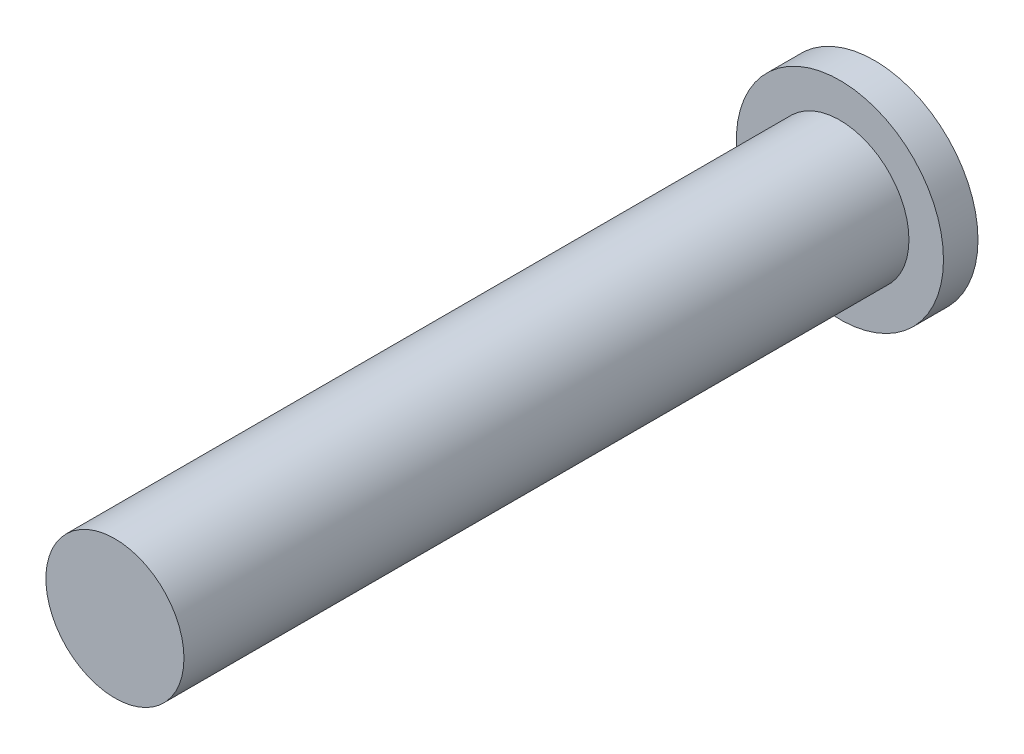
ISO-10303-21;
HEADER;
FILE_DESCRIPTION(('STEP AP214'),'2;1');
FILE_NAME('part.step','',(''),(''),'','','');
FILE_SCHEMA(('AUTOMOTIVE_DESIGN { 1 0 10303 214 1 1 1 1 }'));
ENDSEC;
DATA;
#1=APPLICATION_CONTEXT('core data for automotive mechanical design processes');
#2=APPLICATION_PROTOCOL_DEFINITION('international standard','automotive_design',2000,#1);
#3=PRODUCT_CONTEXT('',#1,'mechanical');
#4=PRODUCT('Part','Part','',(#3));
#5=PRODUCT_RELATED_PRODUCT_CATEGORY('part','',(#4));
#6=PRODUCT_DEFINITION_FORMATION('','',#4);
#7=PRODUCT_DEFINITION_CONTEXT('part definition',#1,'design');
#8=PRODUCT_DEFINITION('design','',#6,#7);
#9=PRODUCT_DEFINITION_SHAPE('','',#8);
#10=(LENGTH_UNIT() NAMED_UNIT(*) SI_UNIT(.MILLI.,.METRE.));
#11=(NAMED_UNIT(*) PLANE_ANGLE_UNIT() SI_UNIT($,.RADIAN.));
#12=(NAMED_UNIT(*) SI_UNIT($,.STERADIAN.) SOLID_ANGLE_UNIT());
#13=UNCERTAINTY_MEASURE_WITH_UNIT(LENGTH_MEASURE(1.E-05),#10,'distance_accuracy_value','');
#14=(GEOMETRIC_REPRESENTATION_CONTEXT(3) GLOBAL_UNCERTAINTY_ASSIGNED_CONTEXT((#13)) GLOBAL_UNIT_ASSIGNED_CONTEXT((#10,
#11,#12)) REPRESENTATION_CONTEXT('',''));
#15=CARTESIAN_POINT('',(0.,0.,0.));
#16=DIRECTION('',(0.,0.,1.));
#17=DIRECTION('',(1.,0.,0.));
#18=AXIS2_PLACEMENT_3D('',#15,#16,#17);
#19=CARTESIAN_POINT('',(0.,0.,21.));
#20=DIRECTION('',(0.,0.,-1.));
#21=DIRECTION('',(-1.,0.,0.));
#22=AXIS2_PLACEMENT_3D('',#19,#20,#21);
#23=CYLINDRICAL_SURFACE('',#22,2.);
#24=CARTESIAN_POINT('',(0.,0.,21.));
#25=DIRECTION('',(0.,0.,1.));
#26=DIRECTION('',(1.,0.,0.));
#27=AXIS2_PLACEMENT_3D('',#24,#25,#26);
#28=CIRCLE('',#27,2.);
#29=CARTESIAN_POINT('',(2.,0.,21.));
#30=VERTEX_POINT('',#29);
#31=EDGE_CURVE('E10',#30,#30,#28,.T.);
#32=ORIENTED_EDGE('',*,*,#31,.F.);
#33=EDGE_LOOP('',(#32));
#34=FACE_BOUND('',#33,.T.);
#35=CARTESIAN_POINT('',(0.,0.,0.));
#36=DIRECTION('',(0.,0.,1.));
#37=DIRECTION('',(1.,0.,0.));
#38=AXIS2_PLACEMENT_3D('',#35,#36,#37);
#39=CIRCLE('',#38,2.);
#40=CARTESIAN_POINT('',(2.,0.,0.));
#41=VERTEX_POINT('',#40);
#42=EDGE_CURVE('E39',#41,#41,#39,.T.);
#43=ORIENTED_EDGE('',*,*,#42,.T.);
#44=EDGE_LOOP('',(#43));
#45=FACE_BOUND('',#44,.T.);
#46=ADVANCED_FACE('F33',(#34,#45),#23,.T.);
#47=CARTESIAN_POINT('',(0.,0.,21.));
#48=DIRECTION('',(0.,0.,1.));
#49=DIRECTION('',(1.,0.,0.));
#50=AXIS2_PLACEMENT_3D('',#47,#48,#49);
#51=PLANE('',#50);
#52=ORIENTED_EDGE('',*,*,#31,.T.);
#53=EDGE_LOOP('',(#52));
#54=FACE_BOUND('',#53,.T.);
#55=ADVANCED_FACE('F67',(#54),#51,.T.);
#56=CARTESIAN_POINT('',(0.,0.,0.));
#57=DIRECTION('',(0.,0.,1.));
#58=DIRECTION('',(1.,0.,0.));
#59=AXIS2_PLACEMENT_3D('',#56,#57,#58);
#60=PLANE('',#59);
#61=CARTESIAN_POINT('',(0.,0.,0.));
#62=DIRECTION('',(0.,0.,1.));
#63=DIRECTION('',(1.,0.,0.));
#64=AXIS2_PLACEMENT_3D('',#61,#62,#63);
#65=CIRCLE('',#64,3.);
#66=CARTESIAN_POINT('',(3.,0.,0.));
#67=VERTEX_POINT('',#66);
#68=EDGE_CURVE('E47',#67,#67,#65,.T.);
#69=ORIENTED_EDGE('',*,*,#68,.T.);
#70=EDGE_LOOP('',(#69));
#71=FACE_BOUND('',#70,.T.);
#72=ORIENTED_EDGE('',*,*,#42,.F.);
#73=EDGE_LOOP('',(#72));
#74=FACE_BOUND('',#73,.T.);
#75=ADVANCED_FACE('F53',(#71,#74),#60,.T.);
#76=CARTESIAN_POINT('',(0.,0.,-1.));
#77=DIRECTION('',(0.,0.,1.));
#78=DIRECTION('',(1.,0.,0.));
#79=AXIS2_PLACEMENT_3D('',#76,#77,#78);
#80=CYLINDRICAL_SURFACE('',#79,3.);
#81=CARTESIAN_POINT('',(0.,0.,-1.));
#82=DIRECTION('',(0.,0.,1.));
#83=DIRECTION('',(1.,0.,0.));
#84=AXIS2_PLACEMENT_3D('',#81,#82,#83);
#85=CIRCLE('',#84,3.);
#86=CARTESIAN_POINT('',(3.,0.,-1.));
#87=VERTEX_POINT('',#86);
#88=EDGE_CURVE('E43',#87,#87,#85,.T.);
#89=ORIENTED_EDGE('',*,*,#88,.T.);
#90=EDGE_LOOP('',(#89));
#91=FACE_BOUND('',#90,.T.);
#92=ORIENTED_EDGE('',*,*,#68,.F.);
#93=EDGE_LOOP('',(#92));
#94=FACE_BOUND('',#93,.T.);
#95=ADVANCED_FACE('F56',(#91,#94),#80,.T.);
#96=CARTESIAN_POINT('',(0.,0.,-1.));
#97=DIRECTION('',(0.,0.,1.));
#98=DIRECTION('',(1.,0.,0.));
#99=AXIS2_PLACEMENT_3D('',#96,#97,#98);
#100=PLANE('',#99);
#101=ORIENTED_EDGE('',*,*,#88,.F.);
#102=EDGE_LOOP('',(#101));
#103=FACE_BOUND('',#102,.T.);
#104=ADVANCED_FACE('F58',(#103),#100,.F.);
#105=CLOSED_SHELL('',(#46,#55,#75,#95,#104));
#106=MANIFOLD_SOLID_BREP('B2',#105);
#107=ADVANCED_BREP_SHAPE_REPRESENTATION('',(#18,#106),#14);
#108=SHAPE_DEFINITION_REPRESENTATION(#9,#107);
ENDSEC;
END-ISO-10303-21;
